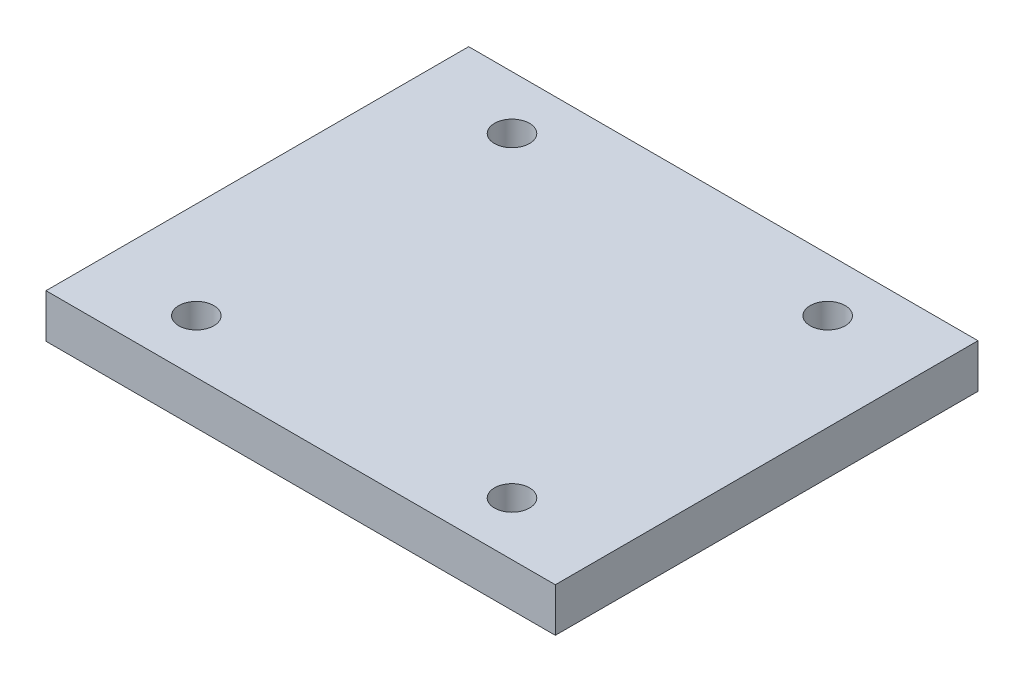
ISO-10303-21;
HEADER;
FILE_DESCRIPTION(('STEP AP214'),'2;1');
FILE_NAME('part.step','',(''),(''),'','','');
FILE_SCHEMA(('AUTOMOTIVE_DESIGN { 1 0 10303 214 1 1 1 1 }'));
ENDSEC;
DATA;
#1=APPLICATION_CONTEXT('core data for automotive mechanical design processes');
#2=APPLICATION_PROTOCOL_DEFINITION('international standard','automotive_design',2000,#1);
#3=PRODUCT_CONTEXT('',#1,'mechanical');
#4=PRODUCT('Part','Part','',(#3));
#5=PRODUCT_RELATED_PRODUCT_CATEGORY('part','',(#4));
#6=PRODUCT_DEFINITION_FORMATION('','',#4);
#7=PRODUCT_DEFINITION_CONTEXT('part definition',#1,'design');
#8=PRODUCT_DEFINITION('design','',#6,#7);
#9=PRODUCT_DEFINITION_SHAPE('','',#8);
#10=(LENGTH_UNIT() NAMED_UNIT(*) SI_UNIT(.MILLI.,.METRE.));
#11=(NAMED_UNIT(*) PLANE_ANGLE_UNIT() SI_UNIT($,.RADIAN.));
#12=(NAMED_UNIT(*) SI_UNIT($,.STERADIAN.) SOLID_ANGLE_UNIT());
#13=UNCERTAINTY_MEASURE_WITH_UNIT(LENGTH_MEASURE(1.E-05),#10,'distance_accuracy_value','');
#14=(GEOMETRIC_REPRESENTATION_CONTEXT(3) GLOBAL_UNCERTAINTY_ASSIGNED_CONTEXT((#13)) GLOBAL_UNIT_ASSIGNED_CONTEXT((#10,
#11,#12)) REPRESENTATION_CONTEXT('',''));
#15=CARTESIAN_POINT('',(0.,0.,0.));
#16=DIRECTION('',(0.,0.,1.));
#17=DIRECTION('',(1.,0.,0.));
#18=AXIS2_PLACEMENT_3D('',#15,#16,#17);
#19=CARTESIAN_POINT('',(0.,2.5,0.));
#20=DIRECTION('',(0.,-1.,0.));
#21=DIRECTION('',(0.,0.,-1.));
#22=AXIS2_PLACEMENT_3D('',#19,#20,#21);
#23=PLANE('',#22);
#24=DIRECTION('',(0.,0.,-1.));
#25=VECTOR('',#24,1.);
#26=CARTESIAN_POINT('',(13.54,2.5,12.));
#27=LINE('',#26,#25);
#28=CARTESIAN_POINT('',(13.54,2.5,12.5));
#29=VERTEX_POINT('',#28);
#30=CARTESIAN_POINT('',(13.54,2.5,-11.6));
#31=VERTEX_POINT('',#30);
#32=EDGE_CURVE('E42',#29,#31,#27,.T.);
#33=ORIENTED_EDGE('',*,*,#32,.T.);
#34=DIRECTION('',(1.,0.,0.));
#35=VECTOR('',#34,1.);
#36=CARTESIAN_POINT('',(-15.5,2.5,-11.6));
#37=LINE('',#36,#35);
#38=CARTESIAN_POINT('',(-15.5,2.5,-11.6));
#39=VERTEX_POINT('',#38);
#40=EDGE_CURVE('E103',#39,#31,#37,.T.);
#41=ORIENTED_EDGE('',*,*,#40,.F.);
#42=DIRECTION('',(0.,0.,1.));
#43=VECTOR('',#42,1.);
#44=CARTESIAN_POINT('',(-15.5,2.5,12.));
#45=LINE('',#44,#43);
#46=CARTESIAN_POINT('',(-15.5,2.5,12.5));
#47=VERTEX_POINT('',#46);
#48=EDGE_CURVE('E11',#39,#47,#45,.T.);
#49=ORIENTED_EDGE('',*,*,#48,.T.);
#50=DIRECTION('',(-1.,0.,0.));
#51=VECTOR('',#50,1.);
#52=CARTESIAN_POINT('',(13.54,2.5,12.5));
#53=LINE('',#52,#51);
#54=EDGE_CURVE('E92',#29,#47,#53,.T.);
#55=ORIENTED_EDGE('',*,*,#54,.F.);
#56=EDGE_LOOP('',(#33,#41,#49,#55));
#57=FACE_BOUND('',#56,.T.);
#58=CARTESIAN_POINT('',(-9.98,2.5,-8.55));
#59=DIRECTION('',(0.,1.,0.));
#60=DIRECTION('',(0.,0.,1.));
#61=AXIS2_PLACEMENT_3D('',#58,#59,#60);
#62=CIRCLE('',#61,1.);
#63=CARTESIAN_POINT('',(-9.98,2.5,-7.55));
#64=VERTEX_POINT('',#63);
#65=EDGE_CURVE('E124',#64,#64,#62,.T.);
#66=ORIENTED_EDGE('',*,*,#65,.F.);
#67=EDGE_LOOP('',(#66));
#68=FACE_BOUND('',#67,.T.);
#69=CARTESIAN_POINT('',(8.02,2.5,-8.55));
#70=DIRECTION('',(0.,1.,0.));
#71=DIRECTION('',(0.,0.,1.));
#72=AXIS2_PLACEMENT_3D('',#69,#70,#71);
#73=CIRCLE('',#72,1.);
#74=CARTESIAN_POINT('',(8.02,2.5,-7.55));
#75=VERTEX_POINT('',#74);
#76=EDGE_CURVE('E118',#75,#75,#73,.T.);
#77=ORIENTED_EDGE('',*,*,#76,.F.);
#78=EDGE_LOOP('',(#77));
#79=FACE_BOUND('',#78,.T.);
#80=CARTESIAN_POINT('',(8.02,2.5,9.45));
#81=DIRECTION('',(0.,1.,0.));
#82=DIRECTION('',(0.,0.,1.));
#83=AXIS2_PLACEMENT_3D('',#80,#81,#82);
#84=CIRCLE('',#83,1.);
#85=CARTESIAN_POINT('',(8.02,2.5,10.45));
#86=VERTEX_POINT('',#85);
#87=EDGE_CURVE('E112',#86,#86,#84,.T.);
#88=ORIENTED_EDGE('',*,*,#87,.F.);
#89=EDGE_LOOP('',(#88));
#90=FACE_BOUND('',#89,.T.);
#91=CARTESIAN_POINT('',(-9.98,2.5,9.45));
#92=DIRECTION('',(0.,1.,0.));
#93=DIRECTION('',(0.,0.,1.));
#94=AXIS2_PLACEMENT_3D('',#91,#92,#93);
#95=CIRCLE('',#94,0.999999999999999);
#96=CARTESIAN_POINT('',(-9.98,2.5,10.45));
#97=VERTEX_POINT('',#96);
#98=EDGE_CURVE('E106',#97,#97,#95,.T.);
#99=ORIENTED_EDGE('',*,*,#98,.F.);
#100=EDGE_LOOP('',(#99));
#101=FACE_BOUND('',#100,.T.);
#102=ADVANCED_FACE('F33',(#57,#68,#79,#90,#101),#23,.F.);
#103=CARTESIAN_POINT('',(0.,0.,0.));
#104=DIRECTION('',(0.,-1.,0.));
#105=DIRECTION('',(0.,0.,-1.));
#106=AXIS2_PLACEMENT_3D('',#103,#104,#105);
#107=PLANE('',#106);
#108=CARTESIAN_POINT('',(8.02,0.,9.45));
#109=DIRECTION('',(0.,1.,0.));
#110=DIRECTION('',(0.,0.,1.));
#111=AXIS2_PLACEMENT_3D('',#108,#109,#110);
#112=CIRCLE('',#111,1.);
#113=CARTESIAN_POINT('',(8.02,0.,10.45));
#114=VERTEX_POINT('',#113);
#115=EDGE_CURVE('E109',#114,#114,#112,.T.);
#116=ORIENTED_EDGE('',*,*,#115,.T.);
#117=EDGE_LOOP('',(#116));
#118=FACE_BOUND('',#117,.T.);
#119=CARTESIAN_POINT('',(-9.98,0.,-8.55));
#120=DIRECTION('',(0.,1.,0.));
#121=DIRECTION('',(0.,0.,1.));
#122=AXIS2_PLACEMENT_3D('',#119,#120,#121);
#123=CIRCLE('',#122,1.);
#124=CARTESIAN_POINT('',(-9.98,0.,-7.55));
#125=VERTEX_POINT('',#124);
#126=EDGE_CURVE('E121',#125,#125,#123,.T.);
#127=ORIENTED_EDGE('',*,*,#126,.T.);
#128=EDGE_LOOP('',(#127));
#129=FACE_BOUND('',#128,.T.);
#130=DIRECTION('',(0.,0.,-1.));
#131=VECTOR('',#130,1.);
#132=CARTESIAN_POINT('',(13.54,0.,12.));
#133=LINE('',#132,#131);
#134=CARTESIAN_POINT('',(13.54,0.,12.5));
#135=VERTEX_POINT('',#134);
#136=CARTESIAN_POINT('',(13.54,0.,-11.6));
#137=VERTEX_POINT('',#136);
#138=EDGE_CURVE('E80',#135,#137,#133,.T.);
#139=ORIENTED_EDGE('',*,*,#138,.F.);
#140=DIRECTION('',(1.,0.,0.));
#141=VECTOR('',#140,1.);
#142=CARTESIAN_POINT('',(-15.5,0.,12.5));
#143=LINE('',#142,#141);
#144=CARTESIAN_POINT('',(-15.5,0.,12.5));
#145=VERTEX_POINT('',#144);
#146=EDGE_CURVE('E82',#145,#135,#143,.T.);
#147=ORIENTED_EDGE('',*,*,#146,.F.);
#148=DIRECTION('',(0.,0.,1.));
#149=VECTOR('',#148,1.);
#150=CARTESIAN_POINT('',(-15.5,0.,12.));
#151=LINE('',#150,#149);
#152=CARTESIAN_POINT('',(-15.5,0.,-11.6));
#153=VERTEX_POINT('',#152);
#154=EDGE_CURVE('E37',#153,#145,#151,.T.);
#155=ORIENTED_EDGE('',*,*,#154,.F.);
#156=DIRECTION('',(-1.,0.,0.));
#157=VECTOR('',#156,1.);
#158=CARTESIAN_POINT('',(13.54,0.,-11.6));
#159=LINE('',#158,#157);
#160=EDGE_CURVE('E100',#137,#153,#159,.T.);
#161=ORIENTED_EDGE('',*,*,#160,.F.);
#162=EDGE_LOOP('',(#139,#147,#155,#161));
#163=FACE_BOUND('',#162,.T.);
#164=CARTESIAN_POINT('',(8.02,0.,-8.55));
#165=DIRECTION('',(0.,1.,0.));
#166=DIRECTION('',(0.,0.,1.));
#167=AXIS2_PLACEMENT_3D('',#164,#165,#166);
#168=CIRCLE('',#167,1.);
#169=CARTESIAN_POINT('',(8.02,0.,-7.55));
#170=VERTEX_POINT('',#169);
#171=EDGE_CURVE('E115',#170,#170,#168,.T.);
#172=ORIENTED_EDGE('',*,*,#171,.T.);
#173=EDGE_LOOP('',(#172));
#174=FACE_BOUND('',#173,.T.);
#175=CARTESIAN_POINT('',(-9.98,0.,9.45));
#176=DIRECTION('',(0.,1.,0.));
#177=DIRECTION('',(0.,0.,1.));
#178=AXIS2_PLACEMENT_3D('',#175,#176,#177);
#179=CIRCLE('',#178,0.999999999999999);
#180=CARTESIAN_POINT('',(-9.98,0.,10.45));
#181=VERTEX_POINT('',#180);
#182=EDGE_CURVE('E105',#181,#181,#179,.T.);
#183=ORIENTED_EDGE('',*,*,#182,.T.);
#184=EDGE_LOOP('',(#183));
#185=FACE_BOUND('',#184,.T.);
#186=ADVANCED_FACE('F83',(#118,#129,#163,#174,#185),#107,.T.);
#187=CARTESIAN_POINT('',(13.54,2.5,12.));
#188=DIRECTION('',(-1.,0.,0.));
#189=DIRECTION('',(0.,0.,1.));
#190=AXIS2_PLACEMENT_3D('',#187,#188,#189);
#191=PLANE('',#190);
#192=ORIENTED_EDGE('',*,*,#138,.T.);
#193=DIRECTION('',(0.,-1.,0.));
#194=VECTOR('',#193,1.);
#195=CARTESIAN_POINT('',(13.54,2.5,-11.6));
#196=LINE('',#195,#194);
#197=EDGE_CURVE('E97',#31,#137,#196,.T.);
#198=ORIENTED_EDGE('',*,*,#197,.F.);
#199=ORIENTED_EDGE('',*,*,#32,.F.);
#200=DIRECTION('',(0.,1.,0.));
#201=VECTOR('',#200,1.);
#202=CARTESIAN_POINT('',(13.54,0.,12.5));
#203=LINE('',#202,#201);
#204=EDGE_CURVE('E88',#135,#29,#203,.T.);
#205=ORIENTED_EDGE('',*,*,#204,.F.);
#206=EDGE_LOOP('',(#192,#198,#199,#205));
#207=FACE_BOUND('',#206,.T.);
#208=ADVANCED_FACE('F35',(#207),#191,.F.);
#209=CARTESIAN_POINT('',(-15.5,2.5,12.));
#210=DIRECTION('',(1.,0.,0.));
#211=DIRECTION('',(0.,0.,-1.));
#212=AXIS2_PLACEMENT_3D('',#209,#210,#211);
#213=PLANE('',#212);
#214=ORIENTED_EDGE('',*,*,#154,.T.);
#215=DIRECTION('',(0.,-1.,0.));
#216=VECTOR('',#215,1.);
#217=CARTESIAN_POINT('',(-15.5,2.5,12.5));
#218=LINE('',#217,#216);
#219=EDGE_CURVE('E75',#47,#145,#218,.T.);
#220=ORIENTED_EDGE('',*,*,#219,.F.);
#221=ORIENTED_EDGE('',*,*,#48,.F.);
#222=DIRECTION('',(0.,1.,0.));
#223=VECTOR('',#222,1.);
#224=CARTESIAN_POINT('',(-15.5,0.,-11.6));
#225=LINE('',#224,#223);
#226=EDGE_CURVE('E76',#153,#39,#225,.T.);
#227=ORIENTED_EDGE('',*,*,#226,.F.);
#228=EDGE_LOOP('',(#214,#220,#221,#227));
#229=FACE_BOUND('',#228,.T.);
#230=ADVANCED_FACE('F73',(#229),#213,.F.);
#231=CARTESIAN_POINT('',(-9.98,2.5,-8.55));
#232=DIRECTION('',(0.,-1.,0.));
#233=DIRECTION('',(0.,0.,-1.));
#234=AXIS2_PLACEMENT_3D('',#231,#232,#233);
#235=CYLINDRICAL_SURFACE('',#234,1.);
#236=ORIENTED_EDGE('',*,*,#65,.T.);
#237=EDGE_LOOP('',(#236));
#238=FACE_BOUND('',#237,.T.);
#239=ORIENTED_EDGE('',*,*,#126,.F.);
#240=EDGE_LOOP('',(#239));
#241=FACE_BOUND('',#240,.T.);
#242=ADVANCED_FACE('F160',(#238,#241),#235,.F.);
#243=CARTESIAN_POINT('',(8.02,2.5,-8.55));
#244=DIRECTION('',(0.,-1.,0.));
#245=DIRECTION('',(0.,0.,-1.));
#246=AXIS2_PLACEMENT_3D('',#243,#244,#245);
#247=CYLINDRICAL_SURFACE('',#246,1.);
#248=ORIENTED_EDGE('',*,*,#76,.T.);
#249=EDGE_LOOP('',(#248));
#250=FACE_BOUND('',#249,.T.);
#251=ORIENTED_EDGE('',*,*,#171,.F.);
#252=EDGE_LOOP('',(#251));
#253=FACE_BOUND('',#252,.T.);
#254=ADVANCED_FACE('F164',(#250,#253),#247,.F.);
#255=CARTESIAN_POINT('',(8.02,2.5,9.45));
#256=DIRECTION('',(0.,-1.,0.));
#257=DIRECTION('',(0.,0.,-1.));
#258=AXIS2_PLACEMENT_3D('',#255,#256,#257);
#259=CYLINDRICAL_SURFACE('',#258,1.);
#260=ORIENTED_EDGE('',*,*,#87,.T.);
#261=EDGE_LOOP('',(#260));
#262=FACE_BOUND('',#261,.T.);
#263=ORIENTED_EDGE('',*,*,#115,.F.);
#264=EDGE_LOOP('',(#263));
#265=FACE_BOUND('',#264,.T.);
#266=ADVANCED_FACE('F147',(#262,#265),#259,.F.);
#267=CARTESIAN_POINT('',(-9.98,2.5,9.45));
#268=DIRECTION('',(0.,-1.,0.));
#269=DIRECTION('',(0.,0.,-1.));
#270=AXIS2_PLACEMENT_3D('',#267,#268,#269);
#271=CYLINDRICAL_SURFACE('',#270,0.999999999999999);
#272=ORIENTED_EDGE('',*,*,#98,.T.);
#273=EDGE_LOOP('',(#272));
#274=FACE_BOUND('',#273,.T.);
#275=ORIENTED_EDGE('',*,*,#182,.F.);
#276=EDGE_LOOP('',(#275));
#277=FACE_BOUND('',#276,.T.);
#278=ADVANCED_FACE('F144',(#274,#277),#271,.F.);
#279=CARTESIAN_POINT('',(0.,0.,-11.6));
#280=DIRECTION('',(0.,0.,-1.));
#281=DIRECTION('',(-1.,0.,0.));
#282=AXIS2_PLACEMENT_3D('',#279,#280,#281);
#283=PLANE('',#282);
#284=ORIENTED_EDGE('',*,*,#197,.T.);
#285=ORIENTED_EDGE('',*,*,#160,.T.);
#286=ORIENTED_EDGE('',*,*,#226,.T.);
#287=ORIENTED_EDGE('',*,*,#40,.T.);
#288=EDGE_LOOP('',(#284,#285,#286,#287));
#289=FACE_BOUND('',#288,.T.);
#290=ADVANCED_FACE('F132',(#289),#283,.T.);
#291=CARTESIAN_POINT('',(0.,0.,12.5));
#292=DIRECTION('',(0.,0.,1.));
#293=DIRECTION('',(1.,0.,0.));
#294=AXIS2_PLACEMENT_3D('',#291,#292,#293);
#295=PLANE('',#294);
#296=ORIENTED_EDGE('',*,*,#219,.T.);
#297=ORIENTED_EDGE('',*,*,#146,.T.);
#298=ORIENTED_EDGE('',*,*,#204,.T.);
#299=ORIENTED_EDGE('',*,*,#54,.T.);
#300=EDGE_LOOP('',(#296,#297,#298,#299));
#301=FACE_BOUND('',#300,.T.);
#302=ADVANCED_FACE('F91',(#301),#295,.T.);
#303=CLOSED_SHELL('',(#102,#186,#208,#230,#242,#254,#266,#278,#290,#302));
#304=MANIFOLD_SOLID_BREP('B2',#303);
#305=ADVANCED_BREP_SHAPE_REPRESENTATION('',(#18,#304),#14);
#306=SHAPE_DEFINITION_REPRESENTATION(#9,#305);
ENDSEC;
END-ISO-10303-21;
